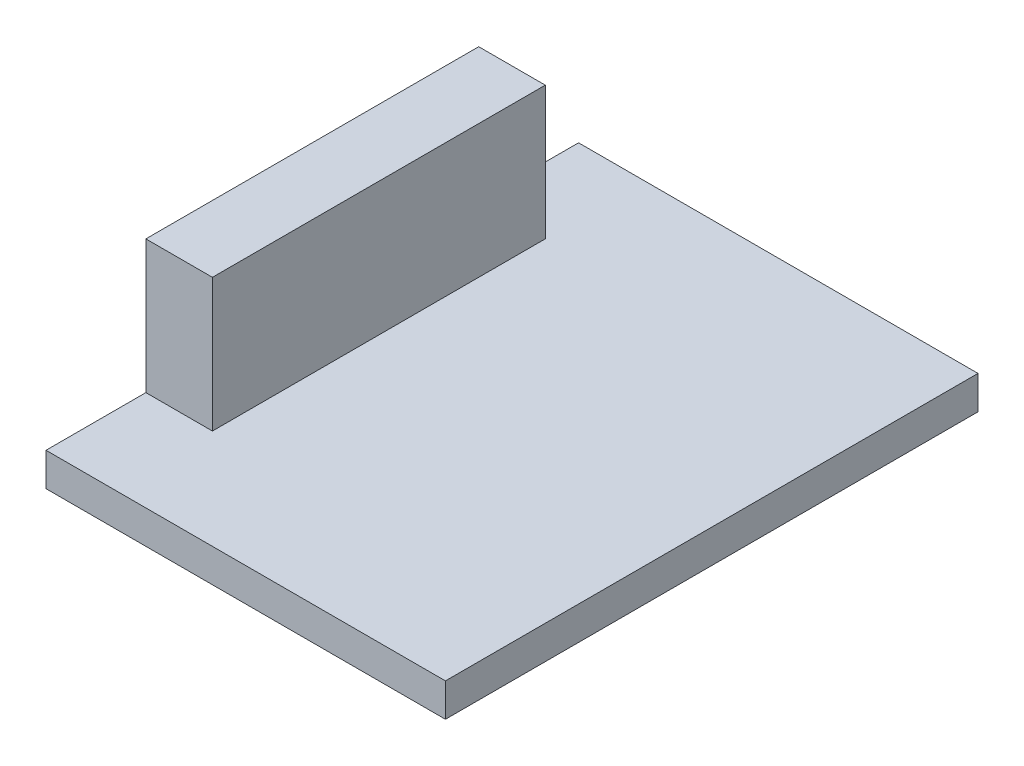
ISO-10303-21;
HEADER;
FILE_DESCRIPTION(('STEP AP214'),'2;1');
FILE_NAME('part.step','',(''),(''),'','','');
FILE_SCHEMA(('AUTOMOTIVE_DESIGN { 1 0 10303 214 1 1 1 1 }'));
ENDSEC;
DATA;
#1=APPLICATION_CONTEXT('core data for automotive mechanical design processes');
#2=APPLICATION_PROTOCOL_DEFINITION('international standard','automotive_design',2000,#1);
#3=PRODUCT_CONTEXT('',#1,'mechanical');
#4=PRODUCT('Part','Part','',(#3));
#5=PRODUCT_RELATED_PRODUCT_CATEGORY('part','',(#4));
#6=PRODUCT_DEFINITION_FORMATION('','',#4);
#7=PRODUCT_DEFINITION_CONTEXT('part definition',#1,'design');
#8=PRODUCT_DEFINITION('design','',#6,#7);
#9=PRODUCT_DEFINITION_SHAPE('','',#8);
#10=(LENGTH_UNIT() NAMED_UNIT(*) SI_UNIT(.MILLI.,.METRE.));
#11=(NAMED_UNIT(*) PLANE_ANGLE_UNIT() SI_UNIT($,.RADIAN.));
#12=(NAMED_UNIT(*) SI_UNIT($,.STERADIAN.) SOLID_ANGLE_UNIT());
#13=UNCERTAINTY_MEASURE_WITH_UNIT(LENGTH_MEASURE(1.E-05),#10,'distance_accuracy_value','');
#14=(GEOMETRIC_REPRESENTATION_CONTEXT(3) GLOBAL_UNCERTAINTY_ASSIGNED_CONTEXT((#13)) GLOBAL_UNIT_ASSIGNED_CONTEXT((#10,
#11,#12)) REPRESENTATION_CONTEXT('',''));
#15=CARTESIAN_POINT('',(0.,0.,0.));
#16=DIRECTION('',(0.,0.,1.));
#17=DIRECTION('',(1.,0.,0.));
#18=AXIS2_PLACEMENT_3D('',#15,#16,#17);
#19=CARTESIAN_POINT('',(0.,1.5875,0.));
#20=DIRECTION('',(0.,-1.,0.));
#21=DIRECTION('',(0.,0.,-1.));
#22=AXIS2_PLACEMENT_3D('',#19,#20,#21);
#23=PLANE('',#22);
#24=DIRECTION('',(1.,0.,0.));
#25=VECTOR('',#24,1.);
#26=CARTESIAN_POINT('',(3.175,1.5875,-4.7625));
#27=LINE('',#26,#25);
#28=CARTESIAN_POINT('',(0.,1.5875,-4.7625));
#29=VERTEX_POINT('',#28);
#30=CARTESIAN_POINT('',(3.175,1.5875,-4.7625));
#31=VERTEX_POINT('',#30);
#32=EDGE_CURVE('E53',#29,#31,#27,.T.);
#33=ORIENTED_EDGE('',*,*,#32,.F.);
#34=DIRECTION('',(0.,0.,1.));
#35=VECTOR('',#34,1.);
#36=CARTESIAN_POINT('',(0.,1.5875,0.));
#37=LINE('',#36,#35);
#38=CARTESIAN_POINT('',(0.,1.5875,0.));
#39=VERTEX_POINT('',#38);
#40=EDGE_CURVE('E130',#29,#39,#37,.T.);
#41=ORIENTED_EDGE('',*,*,#40,.T.);
#42=DIRECTION('',(1.,0.,0.));
#43=VECTOR('',#42,1.);
#44=CARTESIAN_POINT('',(0.,1.5875,0.));
#45=LINE('',#44,#43);
#46=CARTESIAN_POINT('',(19.05,1.5875,0.));
#47=VERTEX_POINT('',#46);
#48=EDGE_CURVE('E129',#39,#47,#45,.T.);
#49=ORIENTED_EDGE('',*,*,#48,.T.);
#50=DIRECTION('',(0.,0.,-1.));
#51=VECTOR('',#50,1.);
#52=CARTESIAN_POINT('',(19.05,1.5875,0.));
#53=LINE('',#52,#51);
#54=CARTESIAN_POINT('',(19.05,1.5875,-25.4));
#55=VERTEX_POINT('',#54);
#56=EDGE_CURVE('E132',#47,#55,#53,.T.);
#57=ORIENTED_EDGE('',*,*,#56,.T.);
#58=DIRECTION('',(-1.,0.,0.));
#59=VECTOR('',#58,1.);
#60=CARTESIAN_POINT('',(0.,1.5875,-25.4));
#61=LINE('',#60,#59);
#62=CARTESIAN_POINT('',(0.,1.5875,-25.4));
#63=VERTEX_POINT('',#62);
#64=EDGE_CURVE('E134',#55,#63,#61,.T.);
#65=ORIENTED_EDGE('',*,*,#64,.T.);
#66=CARTESIAN_POINT('',(0.,1.5875,-20.6375));
#67=VERTEX_POINT('',#66);
#68=EDGE_CURVE('E127',#63,#67,#37,.T.);
#69=ORIENTED_EDGE('',*,*,#68,.T.);
#70=DIRECTION('',(-1.,0.,0.));
#71=VECTOR('',#70,1.);
#72=CARTESIAN_POINT('',(0.,1.5875,-20.6375));
#73=LINE('',#72,#71);
#74=CARTESIAN_POINT('',(3.175,1.5875,-20.6375));
#75=VERTEX_POINT('',#74);
#76=EDGE_CURVE('E115',#75,#67,#73,.T.);
#77=ORIENTED_EDGE('',*,*,#76,.F.);
#78=DIRECTION('',(0.,0.,-1.));
#79=VECTOR('',#78,1.);
#80=CARTESIAN_POINT('',(3.175,1.5875,-20.6375));
#81=LINE('',#80,#79);
#82=EDGE_CURVE('E48',#31,#75,#81,.T.);
#83=ORIENTED_EDGE('',*,*,#82,.F.);
#84=EDGE_LOOP('',(#33,#41,#49,#57,#65,#69,#77,#83));
#85=FACE_BOUND('',#84,.T.);
#86=ADVANCED_FACE('F33',(#85),#23,.F.);
#87=CARTESIAN_POINT('',(0.,1.5875,0.));
#88=DIRECTION('',(1.,0.,0.));
#89=DIRECTION('',(0.,0.,-1.));
#90=AXIS2_PLACEMENT_3D('',#87,#88,#89);
#91=PLANE('',#90);
#92=DIRECTION('',(0.,0.,1.));
#93=VECTOR('',#92,1.);
#94=CARTESIAN_POINT('',(0.,0.,0.));
#95=LINE('',#94,#93);
#96=CARTESIAN_POINT('',(0.,0.,-25.4));
#97=VERTEX_POINT('',#96);
#98=CARTESIAN_POINT('',(0.,0.,0.));
#99=VERTEX_POINT('',#98);
#100=EDGE_CURVE('E118',#97,#99,#95,.T.);
#101=ORIENTED_EDGE('',*,*,#100,.T.);
#102=DIRECTION('',(0.,-1.,0.));
#103=VECTOR('',#102,1.);
#104=CARTESIAN_POINT('',(0.,1.5875,0.));
#105=LINE('',#104,#103);
#106=EDGE_CURVE('E11',#39,#99,#105,.T.);
#107=ORIENTED_EDGE('',*,*,#106,.F.);
#108=ORIENTED_EDGE('',*,*,#40,.F.);
#109=DIRECTION('',(0.,-1.,0.));
#110=VECTOR('',#109,1.);
#111=CARTESIAN_POINT('',(0.,7.9375,-4.7625));
#112=LINE('',#111,#110);
#113=CARTESIAN_POINT('',(0.,7.9375,-4.7625));
#114=VERTEX_POINT('',#113);
#115=EDGE_CURVE('E175',#114,#29,#112,.T.);
#116=ORIENTED_EDGE('',*,*,#115,.F.);
#117=DIRECTION('',(0.,0.,1.));
#118=VECTOR('',#117,1.);
#119=CARTESIAN_POINT('',(0.,7.9375,-4.7625));
#120=LINE('',#119,#118);
#121=CARTESIAN_POINT('',(0.,7.9375,-20.6375));
#122=VERTEX_POINT('',#121);
#123=EDGE_CURVE('E111',#122,#114,#120,.T.);
#124=ORIENTED_EDGE('',*,*,#123,.F.);
#125=DIRECTION('',(0.,-1.,0.));
#126=VECTOR('',#125,1.);
#127=CARTESIAN_POINT('',(0.,7.9375,-20.6375));
#128=LINE('',#127,#126);
#129=EDGE_CURVE('E123',#122,#67,#128,.T.);
#130=ORIENTED_EDGE('',*,*,#129,.T.);
#131=ORIENTED_EDGE('',*,*,#68,.F.);
#132=DIRECTION('',(0.,-1.,0.));
#133=VECTOR('',#132,1.);
#134=CARTESIAN_POINT('',(0.,1.5875,-25.4));
#135=LINE('',#134,#133);
#136=EDGE_CURVE('E135',#63,#97,#135,.T.);
#137=ORIENTED_EDGE('',*,*,#136,.T.);
#138=EDGE_LOOP('',(#101,#107,#108,#116,#124,#130,#131,#137));
#139=FACE_BOUND('',#138,.T.);
#140=ADVANCED_FACE('F35',(#139),#91,.F.);
#141=CARTESIAN_POINT('',(0.,1.5875,0.));
#142=DIRECTION('',(0.,0.,-1.));
#143=DIRECTION('',(-1.,0.,0.));
#144=AXIS2_PLACEMENT_3D('',#141,#142,#143);
#145=PLANE('',#144);
#146=DIRECTION('',(1.,0.,0.));
#147=VECTOR('',#146,1.);
#148=CARTESIAN_POINT('',(0.,0.,0.));
#149=LINE('',#148,#147);
#150=CARTESIAN_POINT('',(19.05,0.,0.));
#151=VERTEX_POINT('',#150);
#152=EDGE_CURVE('E121',#99,#151,#149,.T.);
#153=ORIENTED_EDGE('',*,*,#152,.T.);
#154=DIRECTION('',(0.,-1.,0.));
#155=VECTOR('',#154,1.);
#156=CARTESIAN_POINT('',(19.05,1.5875,0.));
#157=LINE('',#156,#155);
#158=EDGE_CURVE('E41',#47,#151,#157,.T.);
#159=ORIENTED_EDGE('',*,*,#158,.F.);
#160=ORIENTED_EDGE('',*,*,#48,.F.);
#161=ORIENTED_EDGE('',*,*,#106,.T.);
#162=EDGE_LOOP('',(#153,#159,#160,#161));
#163=FACE_BOUND('',#162,.T.);
#164=ADVANCED_FACE('F178',(#163),#145,.F.);
#165=CARTESIAN_POINT('',(19.05,1.5875,0.));
#166=DIRECTION('',(-1.,0.,0.));
#167=DIRECTION('',(0.,0.,1.));
#168=AXIS2_PLACEMENT_3D('',#165,#166,#167);
#169=PLANE('',#168);
#170=DIRECTION('',(0.,0.,-1.));
#171=VECTOR('',#170,1.);
#172=CARTESIAN_POINT('',(19.05,0.,0.));
#173=LINE('',#172,#171);
#174=CARTESIAN_POINT('',(19.05,0.,-25.4));
#175=VERTEX_POINT('',#174);
#176=EDGE_CURVE('E138',#151,#175,#173,.T.);
#177=ORIENTED_EDGE('',*,*,#176,.T.);
#178=DIRECTION('',(0.,-1.,0.));
#179=VECTOR('',#178,1.);
#180=CARTESIAN_POINT('',(19.05,1.5875,-25.4));
#181=LINE('',#180,#179);
#182=EDGE_CURVE('E144',#55,#175,#181,.T.);
#183=ORIENTED_EDGE('',*,*,#182,.F.);
#184=ORIENTED_EDGE('',*,*,#56,.F.);
#185=ORIENTED_EDGE('',*,*,#158,.T.);
#186=EDGE_LOOP('',(#177,#183,#184,#185));
#187=FACE_BOUND('',#186,.T.);
#188=ADVANCED_FACE('F151',(#187),#169,.F.);
#189=CARTESIAN_POINT('',(0.,1.5875,-25.4));
#190=DIRECTION('',(0.,0.,1.));
#191=DIRECTION('',(1.,0.,0.));
#192=AXIS2_PLACEMENT_3D('',#189,#190,#191);
#193=PLANE('',#192);
#194=DIRECTION('',(-1.,0.,0.));
#195=VECTOR('',#194,1.);
#196=CARTESIAN_POINT('',(0.,0.,-25.4));
#197=LINE('',#196,#195);
#198=EDGE_CURVE('E140',#175,#97,#197,.T.);
#199=ORIENTED_EDGE('',*,*,#198,.T.);
#200=ORIENTED_EDGE('',*,*,#136,.F.);
#201=ORIENTED_EDGE('',*,*,#64,.F.);
#202=ORIENTED_EDGE('',*,*,#182,.T.);
#203=EDGE_LOOP('',(#199,#200,#201,#202));
#204=FACE_BOUND('',#203,.T.);
#205=ADVANCED_FACE('F161',(#204),#193,.F.);
#206=CARTESIAN_POINT('',(0.,0.,0.));
#207=DIRECTION('',(0.,-1.,0.));
#208=DIRECTION('',(0.,0.,-1.));
#209=AXIS2_PLACEMENT_3D('',#206,#207,#208);
#210=PLANE('',#209);
#211=ORIENTED_EDGE('',*,*,#100,.F.);
#212=ORIENTED_EDGE('',*,*,#198,.F.);
#213=ORIENTED_EDGE('',*,*,#176,.F.);
#214=ORIENTED_EDGE('',*,*,#152,.F.);
#215=EDGE_LOOP('',(#211,#212,#213,#214));
#216=FACE_BOUND('',#215,.T.);
#217=ADVANCED_FACE('F158',(#216),#210,.T.);
#218=CARTESIAN_POINT('',(3.175,7.9375,-4.7625));
#219=DIRECTION('',(0.,0.,-1.));
#220=DIRECTION('',(-1.,0.,0.));
#221=AXIS2_PLACEMENT_3D('',#218,#219,#220);
#222=PLANE('',#221);
#223=ORIENTED_EDGE('',*,*,#32,.T.);
#224=DIRECTION('',(0.,-1.,0.));
#225=VECTOR('',#224,1.);
#226=CARTESIAN_POINT('',(3.175,7.9375,-4.7625));
#227=LINE('',#226,#225);
#228=CARTESIAN_POINT('',(3.175,7.9375,-4.7625));
#229=VERTEX_POINT('',#228);
#230=EDGE_CURVE('E100',#229,#31,#227,.T.);
#231=ORIENTED_EDGE('',*,*,#230,.F.);
#232=DIRECTION('',(1.,0.,0.));
#233=VECTOR('',#232,1.);
#234=CARTESIAN_POINT('',(3.175,7.9375,-4.7625));
#235=LINE('',#234,#233);
#236=EDGE_CURVE('E106',#114,#229,#235,.T.);
#237=ORIENTED_EDGE('',*,*,#236,.F.);
#238=ORIENTED_EDGE('',*,*,#115,.T.);
#239=EDGE_LOOP('',(#223,#231,#237,#238));
#240=FACE_BOUND('',#239,.T.);
#241=ADVANCED_FACE('F117',(#240),#222,.F.);
#242=CARTESIAN_POINT('',(3.175,7.9375,-20.6375));
#243=DIRECTION('',(-1.,0.,0.));
#244=DIRECTION('',(0.,0.,1.));
#245=AXIS2_PLACEMENT_3D('',#242,#243,#244);
#246=PLANE('',#245);
#247=ORIENTED_EDGE('',*,*,#82,.T.);
#248=DIRECTION('',(0.,-1.,0.));
#249=VECTOR('',#248,1.);
#250=CARTESIAN_POINT('',(3.175,7.9375,-20.6375));
#251=LINE('',#250,#249);
#252=CARTESIAN_POINT('',(3.175,7.9375,-20.6375));
#253=VERTEX_POINT('',#252);
#254=EDGE_CURVE('E102',#253,#75,#251,.T.);
#255=ORIENTED_EDGE('',*,*,#254,.F.);
#256=DIRECTION('',(0.,0.,-1.));
#257=VECTOR('',#256,1.);
#258=CARTESIAN_POINT('',(3.175,7.9375,-20.6375));
#259=LINE('',#258,#257);
#260=EDGE_CURVE('E96',#229,#253,#259,.T.);
#261=ORIENTED_EDGE('',*,*,#260,.F.);
#262=ORIENTED_EDGE('',*,*,#230,.T.);
#263=EDGE_LOOP('',(#247,#255,#261,#262));
#264=FACE_BOUND('',#263,.T.);
#265=ADVANCED_FACE('F98',(#264),#246,.F.);
#266=CARTESIAN_POINT('',(0.,7.9375,-20.6375));
#267=DIRECTION('',(0.,0.,1.));
#268=DIRECTION('',(1.,0.,0.));
#269=AXIS2_PLACEMENT_3D('',#266,#267,#268);
#270=PLANE('',#269);
#271=ORIENTED_EDGE('',*,*,#76,.T.);
#272=ORIENTED_EDGE('',*,*,#129,.F.);
#273=DIRECTION('',(-1.,0.,0.));
#274=VECTOR('',#273,1.);
#275=CARTESIAN_POINT('',(0.,7.9375,-20.6375));
#276=LINE('',#275,#274);
#277=EDGE_CURVE('E105',#253,#122,#276,.T.);
#278=ORIENTED_EDGE('',*,*,#277,.F.);
#279=ORIENTED_EDGE('',*,*,#254,.T.);
#280=EDGE_LOOP('',(#271,#272,#278,#279));
#281=FACE_BOUND('',#280,.T.);
#282=ADVANCED_FACE('F170',(#281),#270,.F.);
#283=CARTESIAN_POINT('',(0.,7.9375,0.));
#284=DIRECTION('',(0.,-1.,0.));
#285=DIRECTION('',(0.,0.,-1.));
#286=AXIS2_PLACEMENT_3D('',#283,#284,#285);
#287=PLANE('',#286);
#288=ORIENTED_EDGE('',*,*,#236,.T.);
#289=ORIENTED_EDGE('',*,*,#260,.T.);
#290=ORIENTED_EDGE('',*,*,#277,.T.);
#291=ORIENTED_EDGE('',*,*,#123,.T.);
#292=EDGE_LOOP('',(#288,#289,#290,#291));
#293=FACE_BOUND('',#292,.T.);
#294=ADVANCED_FACE('F109',(#293),#287,.F.);
#295=CLOSED_SHELL('',(#86,#140,#164,#188,#205,#217,#241,#265,#282,#294));
#296=MANIFOLD_SOLID_BREP('B2',#295);
#297=ADVANCED_BREP_SHAPE_REPRESENTATION('',(#18,#296),#14);
#298=SHAPE_DEFINITION_REPRESENTATION(#9,#297);
ENDSEC;
END-ISO-10303-21;
